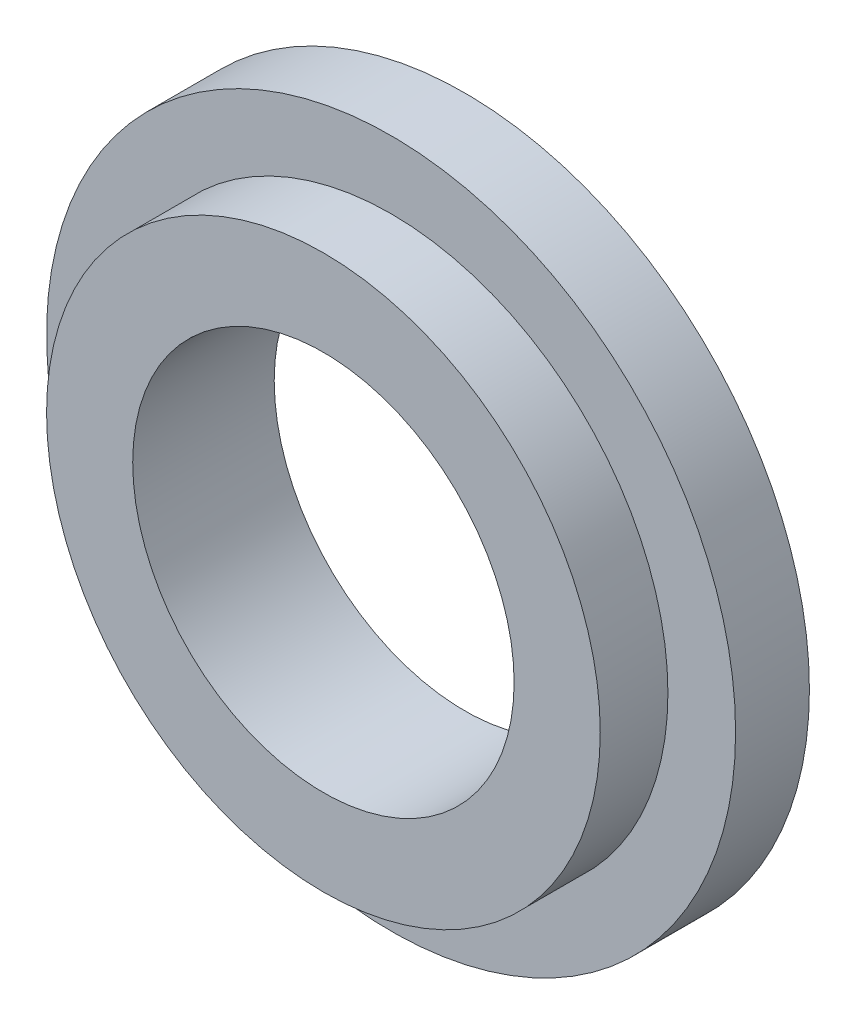
ISO-10303-21;
HEADER;
FILE_DESCRIPTION(('STEP AP214'),'2;1');
FILE_NAME('part.step','',(''),(''),'','','');
FILE_SCHEMA(('AUTOMOTIVE_DESIGN { 1 0 10303 214 1 1 1 1 }'));
ENDSEC;
DATA;
#1=APPLICATION_CONTEXT('core data for automotive mechanical design processes');
#2=APPLICATION_PROTOCOL_DEFINITION('international standard','automotive_design',2000,#1);
#3=PRODUCT_CONTEXT('',#1,'mechanical');
#4=PRODUCT('Part','Part','',(#3));
#5=PRODUCT_RELATED_PRODUCT_CATEGORY('part','',(#4));
#6=PRODUCT_DEFINITION_FORMATION('','',#4);
#7=PRODUCT_DEFINITION_CONTEXT('part definition',#1,'design');
#8=PRODUCT_DEFINITION('design','',#6,#7);
#9=PRODUCT_DEFINITION_SHAPE('','',#8);
#10=(LENGTH_UNIT() NAMED_UNIT(*) SI_UNIT(.MILLI.,.METRE.));
#11=(NAMED_UNIT(*) PLANE_ANGLE_UNIT() SI_UNIT($,.RADIAN.));
#12=(NAMED_UNIT(*) SI_UNIT($,.STERADIAN.) SOLID_ANGLE_UNIT());
#13=UNCERTAINTY_MEASURE_WITH_UNIT(LENGTH_MEASURE(1.E-05),#10,'distance_accuracy_value','');
#14=(GEOMETRIC_REPRESENTATION_CONTEXT(3) GLOBAL_UNCERTAINTY_ASSIGNED_CONTEXT((#13)) GLOBAL_UNIT_ASSIGNED_CONTEXT((#10,
#11,#12)) REPRESENTATION_CONTEXT('',''));
#15=CARTESIAN_POINT('',(0.,0.,0.));
#16=DIRECTION('',(0.,0.,1.));
#17=DIRECTION('',(1.,0.,0.));
#18=AXIS2_PLACEMENT_3D('',#15,#16,#17);
#19=CARTESIAN_POINT('',(0.,0.,3.));
#20=DIRECTION('',(0.,0.,-1.));
#21=DIRECTION('',(-1.,0.,0.));
#22=AXIS2_PLACEMENT_3D('',#19,#20,#21);
#23=CYLINDRICAL_SURFACE('',#22,14.);
#24=CARTESIAN_POINT('',(0.,0.,3.));
#25=DIRECTION('',(0.,0.,1.));
#26=DIRECTION('',(1.,0.,0.));
#27=AXIS2_PLACEMENT_3D('',#24,#25,#26);
#28=CIRCLE('',#27,14.);
#29=CARTESIAN_POINT('',(14.,0.,3.));
#30=VERTEX_POINT('',#29);
#31=EDGE_CURVE('E10',#30,#30,#28,.T.);
#32=ORIENTED_EDGE('',*,*,#31,.F.);
#33=EDGE_LOOP('',(#32));
#34=FACE_BOUND('',#33,.T.);
#35=CARTESIAN_POINT('',(0.,0.,0.));
#36=DIRECTION('',(0.,0.,1.));
#37=DIRECTION('',(1.,0.,0.));
#38=AXIS2_PLACEMENT_3D('',#35,#36,#37);
#39=CIRCLE('',#38,14.);
#40=CARTESIAN_POINT('',(14.,0.,0.));
#41=VERTEX_POINT('',#40);
#42=EDGE_CURVE('E34',#41,#41,#39,.T.);
#43=ORIENTED_EDGE('',*,*,#42,.T.);
#44=EDGE_LOOP('',(#43));
#45=FACE_BOUND('',#44,.T.);
#46=ADVANCED_FACE('F31',(#34,#45),#23,.T.);
#47=CARTESIAN_POINT('',(0.,0.,3.));
#48=DIRECTION('',(0.,0.,1.));
#49=DIRECTION('',(1.,0.,0.));
#50=AXIS2_PLACEMENT_3D('',#47,#48,#49);
#51=PLANE('',#50);
#52=CARTESIAN_POINT('',(0.,0.,3.));
#53=DIRECTION('',(0.,0.,1.));
#54=DIRECTION('',(1.,0.,0.));
#55=AXIS2_PLACEMENT_3D('',#52,#53,#54);
#56=CIRCLE('',#55,11.25);
#57=CARTESIAN_POINT('',(11.25,0.,3.));
#58=VERTEX_POINT('',#57);
#59=EDGE_CURVE('E43',#58,#58,#56,.T.);
#60=ORIENTED_EDGE('',*,*,#59,.F.);
#61=EDGE_LOOP('',(#60));
#62=FACE_BOUND('',#61,.T.);
#63=ORIENTED_EDGE('',*,*,#31,.T.);
#64=EDGE_LOOP('',(#63));
#65=FACE_BOUND('',#64,.T.);
#66=ADVANCED_FACE('F70',(#62,#65),#51,.T.);
#67=CARTESIAN_POINT('',(0.,0.,0.));
#68=DIRECTION('',(0.,0.,1.));
#69=DIRECTION('',(1.,0.,0.));
#70=AXIS2_PLACEMENT_3D('',#67,#68,#69);
#71=PLANE('',#70);
#72=CARTESIAN_POINT('',(0.,0.,0.));
#73=DIRECTION('',(0.,0.,1.));
#74=DIRECTION('',(1.,0.,0.));
#75=AXIS2_PLACEMENT_3D('',#72,#73,#74);
#76=CIRCLE('',#75,7.75);
#77=CARTESIAN_POINT('',(7.75,0.,0.));
#78=VERTEX_POINT('',#77);
#79=EDGE_CURVE('E46',#78,#78,#76,.F.);
#80=ORIENTED_EDGE('',*,*,#79,.F.);
#81=EDGE_LOOP('',(#80));
#82=FACE_BOUND('',#81,.T.);
#83=ORIENTED_EDGE('',*,*,#42,.F.);
#84=EDGE_LOOP('',(#83));
#85=FACE_BOUND('',#84,.T.);
#86=ADVANCED_FACE('F66',(#82,#85),#71,.F.);
#87=CARTESIAN_POINT('',(0.,0.,5.75));
#88=DIRECTION('',(0.,0.,-1.));
#89=DIRECTION('',(-1.,0.,0.));
#90=AXIS2_PLACEMENT_3D('',#87,#88,#89);
#91=CYLINDRICAL_SURFACE('',#90,11.25);
#92=CARTESIAN_POINT('',(0.,0.,5.75));
#93=DIRECTION('',(0.,0.,1.));
#94=DIRECTION('',(1.,0.,0.));
#95=AXIS2_PLACEMENT_3D('',#92,#93,#94);
#96=CIRCLE('',#95,11.25);
#97=CARTESIAN_POINT('',(11.25,0.,5.75));
#98=VERTEX_POINT('',#97);
#99=EDGE_CURVE('E41',#98,#98,#96,.T.);
#100=ORIENTED_EDGE('',*,*,#99,.F.);
#101=EDGE_LOOP('',(#100));
#102=FACE_BOUND('',#101,.T.);
#103=ORIENTED_EDGE('',*,*,#59,.T.);
#104=EDGE_LOOP('',(#103));
#105=FACE_BOUND('',#104,.T.);
#106=ADVANCED_FACE('F60',(#102,#105),#91,.T.);
#107=CARTESIAN_POINT('',(0.,0.,5.75));
#108=DIRECTION('',(0.,0.,1.));
#109=DIRECTION('',(1.,0.,0.));
#110=AXIS2_PLACEMENT_3D('',#107,#108,#109);
#111=PLANE('',#110);
#112=CARTESIAN_POINT('',(0.,0.,5.75));
#113=DIRECTION('',(0.,0.,1.));
#114=DIRECTION('',(1.,0.,0.));
#115=AXIS2_PLACEMENT_3D('',#112,#113,#114);
#116=CIRCLE('',#115,7.75);
#117=CARTESIAN_POINT('',(7.75,0.,5.75));
#118=VERTEX_POINT('',#117);
#119=EDGE_CURVE('E51',#118,#118,#116,.T.);
#120=ORIENTED_EDGE('',*,*,#119,.F.);
#121=EDGE_LOOP('',(#120));
#122=FACE_BOUND('',#121,.T.);
#123=ORIENTED_EDGE('',*,*,#99,.T.);
#124=EDGE_LOOP('',(#123));
#125=FACE_BOUND('',#124,.T.);
#126=ADVANCED_FACE('F57',(#122,#125),#111,.T.);
#127=CARTESIAN_POINT('',(0.,0.,-21.920310216783));
#128=DIRECTION('',(0.,0.,1.));
#129=DIRECTION('',(1.,0.,0.));
#130=AXIS2_PLACEMENT_3D('',#127,#128,#129);
#131=CYLINDRICAL_SURFACE('',#130,7.75);
#132=ORIENTED_EDGE('',*,*,#79,.T.);
#133=EDGE_LOOP('',(#132));
#134=FACE_BOUND('',#133,.T.);
#135=ORIENTED_EDGE('',*,*,#119,.T.);
#136=EDGE_LOOP('',(#135));
#137=FACE_BOUND('',#136,.T.);
#138=ADVANCED_FACE('F55',(#134,#137),#131,.F.);
#139=CLOSED_SHELL('',(#46,#66,#86,#106,#126,#138));
#140=MANIFOLD_SOLID_BREP('B2',#139);
#141=ADVANCED_BREP_SHAPE_REPRESENTATION('',(#18,#140),#14);
#142=SHAPE_DEFINITION_REPRESENTATION(#9,#141);
ENDSEC;
END-ISO-10303-21;
